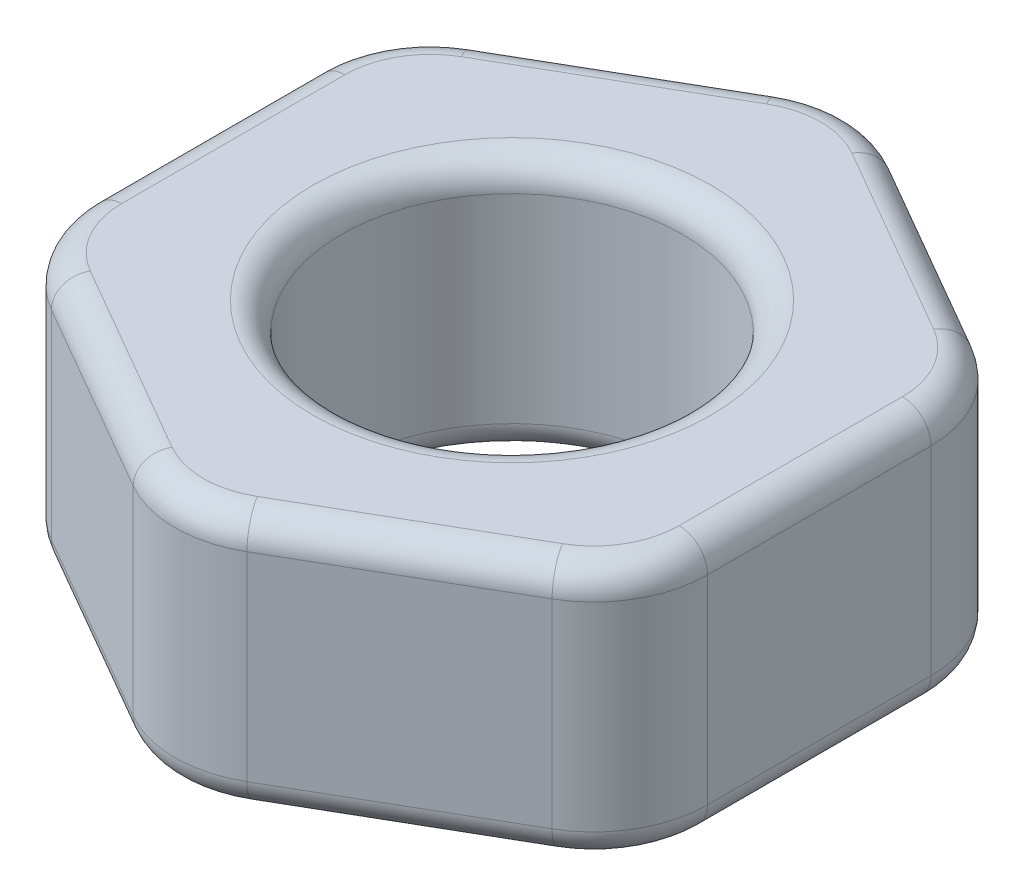
ISO-10303-21;
HEADER;
FILE_DESCRIPTION(('STEP AP214'),'2;1');
FILE_NAME('part.step','',(''),(''),'','','');
FILE_SCHEMA(('AUTOMOTIVE_DESIGN { 1 0 10303 214 1 1 1 1 }'));
ENDSEC;
DATA;
#1=APPLICATION_CONTEXT('core data for automotive mechanical design processes');
#2=APPLICATION_PROTOCOL_DEFINITION('international standard','automotive_design',2000,#1);
#3=PRODUCT_CONTEXT('',#1,'mechanical');
#4=PRODUCT('Part','Part','',(#3));
#5=PRODUCT_RELATED_PRODUCT_CATEGORY('part','',(#4));
#6=PRODUCT_DEFINITION_FORMATION('','',#4);
#7=PRODUCT_DEFINITION_CONTEXT('part definition',#1,'design');
#8=PRODUCT_DEFINITION('design','',#6,#7);
#9=PRODUCT_DEFINITION_SHAPE('','',#8);
#10=(LENGTH_UNIT() NAMED_UNIT(*) SI_UNIT(.MILLI.,.METRE.));
#11=(NAMED_UNIT(*) PLANE_ANGLE_UNIT() SI_UNIT($,.RADIAN.));
#12=(NAMED_UNIT(*) SI_UNIT($,.STERADIAN.) SOLID_ANGLE_UNIT());
#13=UNCERTAINTY_MEASURE_WITH_UNIT(LENGTH_MEASURE(1.E-05),#10,'distance_accuracy_value','');
#14=(GEOMETRIC_REPRESENTATION_CONTEXT(3) GLOBAL_UNCERTAINTY_ASSIGNED_CONTEXT((#13)) GLOBAL_UNIT_ASSIGNED_CONTEXT((#10,
#11,#12)) REPRESENTATION_CONTEXT('',''));
#15=CARTESIAN_POINT('',(0.,0.,0.));
#16=DIRECTION('',(0.,0.,1.));
#17=DIRECTION('',(1.,0.,0.));
#18=AXIS2_PLACEMENT_3D('',#15,#16,#17);
#19=CARTESIAN_POINT('',(0.,2.25,0.));
#20=DIRECTION('',(0.,1.,0.));
#21=DIRECTION('',(0.,0.,1.));
#22=AXIS2_PLACEMENT_3D('',#19,#20,#21);
#23=PLANE('',#22);
#24=CARTESIAN_POINT('',(0.,2.25,0.));
#25=DIRECTION('',(0.,1.,0.));
#26=DIRECTION('',(0.,0.,1.));
#27=AXIS2_PLACEMENT_3D('',#24,#25,#26);
#28=CIRCLE('',#27,1.75);
#29=CARTESIAN_POINT('',(0.,2.25,1.75));
#30=VERTEX_POINT('',#29);
#31=EDGE_CURVE('E11',#30,#30,#28,.F.);
#32=ORIENTED_EDGE('',*,*,#31,.T.);
#33=EDGE_LOOP('',(#32));
#34=FACE_BOUND('',#33,.T.);
#35=DIRECTION('',(0.,0.,-1.));
#36=VECTOR('',#35,1.);
#37=CARTESIAN_POINT('',(2.45,2.25,-0.981495457622363));
#38=LINE('',#37,#36);
#39=CARTESIAN_POINT('',(2.45,2.25,0.981495457622365));
#40=VERTEX_POINT('',#39);
#41=CARTESIAN_POINT('',(2.45,2.25,-0.981495457622363));
#42=VERTEX_POINT('',#41);
#43=EDGE_CURVE('E51',#40,#42,#38,.T.);
#44=ORIENTED_EDGE('',*,*,#43,.T.);
#45=CARTESIAN_POINT('',(1.7,2.25,-0.981495457622363));
#46=DIRECTION('',(0.,1.,0.));
#47=DIRECTION('',(0.,0.,1.));
#48=AXIS2_PLACEMENT_3D('',#45,#46,#47);
#49=CIRCLE('',#48,0.75);
#50=CARTESIAN_POINT('',(2.075,2.25,-1.63101451046069));
#51=VERTEX_POINT('',#50);
#52=EDGE_CURVE('E43',#42,#51,#49,.T.);
#53=ORIENTED_EDGE('',*,*,#52,.T.);
#54=DIRECTION('',(-0.866025403784439,0.,-0.5));
#55=VECTOR('',#54,1.);
#56=CARTESIAN_POINT('',(0.375,2.25,-2.61250996808306));
#57=LINE('',#56,#55);
#58=CARTESIAN_POINT('',(0.375,2.25,-2.61250996808306));
#59=VERTEX_POINT('',#58);
#60=EDGE_CURVE('E285',#51,#59,#57,.T.);
#61=ORIENTED_EDGE('',*,*,#60,.T.);
#62=CARTESIAN_POINT('',(0.,2.25,-1.96299091524473));
#63=DIRECTION('',(0.,1.,0.));
#64=DIRECTION('',(0.,0.,1.));
#65=AXIS2_PLACEMENT_3D('',#62,#63,#64);
#66=CIRCLE('',#65,0.75);
#67=CARTESIAN_POINT('',(-0.375,2.25,-2.61250996808306));
#68=VERTEX_POINT('',#67);
#69=EDGE_CURVE('E287',#59,#68,#66,.T.);
#70=ORIENTED_EDGE('',*,*,#69,.T.);
#71=DIRECTION('',(-0.866025403784439,0.,0.5));
#72=VECTOR('',#71,1.);
#73=CARTESIAN_POINT('',(-2.075,2.25,-1.63101451046069));
#74=LINE('',#73,#72);
#75=CARTESIAN_POINT('',(-2.075,2.25,-1.63101451046069));
#76=VERTEX_POINT('',#75);
#77=EDGE_CURVE('E289',#68,#76,#74,.T.);
#78=ORIENTED_EDGE('',*,*,#77,.T.);
#79=CARTESIAN_POINT('',(-1.7,2.25,-0.981495457622364));
#80=DIRECTION('',(0.,1.,0.));
#81=DIRECTION('',(0.,0.,1.));
#82=AXIS2_PLACEMENT_3D('',#79,#80,#81);
#83=CIRCLE('',#82,0.75);
#84=CARTESIAN_POINT('',(-2.45,2.25,-0.981495457622364));
#85=VERTEX_POINT('',#84);
#86=EDGE_CURVE('E291',#76,#85,#83,.T.);
#87=ORIENTED_EDGE('',*,*,#86,.T.);
#88=DIRECTION('',(0.,0.,1.));
#89=VECTOR('',#88,1.);
#90=CARTESIAN_POINT('',(-2.45,2.25,0.981495457622363));
#91=LINE('',#90,#89);
#92=CARTESIAN_POINT('',(-2.45,2.25,0.981495457622363));
#93=VERTEX_POINT('',#92);
#94=EDGE_CURVE('E293',#85,#93,#91,.T.);
#95=ORIENTED_EDGE('',*,*,#94,.T.);
#96=CARTESIAN_POINT('',(-1.7,2.25,0.981495457622363));
#97=DIRECTION('',(0.,1.,0.));
#98=DIRECTION('',(0.,0.,1.));
#99=AXIS2_PLACEMENT_3D('',#96,#97,#98);
#100=CIRCLE('',#99,0.75);
#101=CARTESIAN_POINT('',(-2.075,2.25,1.63101451046069));
#102=VERTEX_POINT('',#101);
#103=EDGE_CURVE('E295',#93,#102,#100,.T.);
#104=ORIENTED_EDGE('',*,*,#103,.T.);
#105=DIRECTION('',(0.866025403784439,0.,0.5));
#106=VECTOR('',#105,1.);
#107=CARTESIAN_POINT('',(-0.374999999999998,2.25,2.61250996808306));
#108=LINE('',#107,#106);
#109=CARTESIAN_POINT('',(-0.374999999999998,2.25,2.61250996808306));
#110=VERTEX_POINT('',#109);
#111=EDGE_CURVE('E297',#102,#110,#108,.T.);
#112=ORIENTED_EDGE('',*,*,#111,.T.);
#113=CARTESIAN_POINT('',(0.,2.25,1.96299091524473));
#114=DIRECTION('',(0.,1.,0.));
#115=DIRECTION('',(0.,0.,1.));
#116=AXIS2_PLACEMENT_3D('',#113,#114,#115);
#117=CIRCLE('',#116,0.75);
#118=CARTESIAN_POINT('',(0.375000000000002,2.25,2.61250996808306));
#119=VERTEX_POINT('',#118);
#120=EDGE_CURVE('E299',#110,#119,#117,.T.);
#121=ORIENTED_EDGE('',*,*,#120,.T.);
#122=DIRECTION('',(0.866025403784439,0.,-0.5));
#123=VECTOR('',#122,1.);
#124=CARTESIAN_POINT('',(2.075,2.25,1.63101451046069));
#125=LINE('',#124,#123);
#126=CARTESIAN_POINT('',(2.075,2.25,1.63101451046069));
#127=VERTEX_POINT('',#126);
#128=EDGE_CURVE('E301',#119,#127,#125,.T.);
#129=ORIENTED_EDGE('',*,*,#128,.T.);
#130=CARTESIAN_POINT('',(1.7,2.25,0.981495457622365));
#131=DIRECTION('',(0.,1.,0.));
#132=DIRECTION('',(0.,0.,1.));
#133=AXIS2_PLACEMENT_3D('',#130,#131,#132);
#134=CIRCLE('',#133,0.75);
#135=EDGE_CURVE('E56',#127,#40,#134,.T.);
#136=ORIENTED_EDGE('',*,*,#135,.T.);
#137=EDGE_LOOP('',(#44,#53,#61,#70,#78,#87,#95,#104,#112,#121,#129,#136));
#138=FACE_BOUND('',#137,.T.);
#139=ADVANCED_FACE('F34',(#34,#138),#23,.T.);
#140=CARTESIAN_POINT('',(0.,0.,0.));
#141=DIRECTION('',(0.,1.,0.));
#142=DIRECTION('',(0.,0.,1.));
#143=AXIS2_PLACEMENT_3D('',#140,#141,#142);
#144=PLANE('',#143);
#145=CARTESIAN_POINT('',(0.,0.,0.));
#146=DIRECTION('',(0.,1.,0.));
#147=DIRECTION('',(0.,0.,1.));
#148=AXIS2_PLACEMENT_3D('',#145,#146,#147);
#149=CIRCLE('',#148,1.75);
#150=CARTESIAN_POINT('',(0.,0.,1.75));
#151=VERTEX_POINT('',#150);
#152=EDGE_CURVE('E223',#151,#151,#149,.T.);
#153=ORIENTED_EDGE('',*,*,#152,.T.);
#154=EDGE_LOOP('',(#153));
#155=FACE_BOUND('',#154,.T.);
#156=DIRECTION('',(0.,0.,1.));
#157=VECTOR('',#156,1.);
#158=CARTESIAN_POINT('',(-2.45,0.,0.));
#159=LINE('',#158,#157);
#160=CARTESIAN_POINT('',(-2.45,0.,0.981495457622363));
#161=VERTEX_POINT('',#160);
#162=CARTESIAN_POINT('',(-2.45,0.,-0.981495457622364));
#163=VERTEX_POINT('',#162);
#164=EDGE_CURVE('E221',#161,#163,#159,.F.);
#165=ORIENTED_EDGE('',*,*,#164,.T.);
#166=CARTESIAN_POINT('',(-1.7,0.,-0.981495457622364));
#167=DIRECTION('',(0.,1.,0.));
#168=DIRECTION('',(0.,0.,1.));
#169=AXIS2_PLACEMENT_3D('',#166,#167,#168);
#170=CIRCLE('',#169,0.75);
#171=CARTESIAN_POINT('',(-2.075,0.,-1.63101451046069));
#172=VERTEX_POINT('',#171);
#173=EDGE_CURVE('E202',#163,#172,#170,.F.);
#174=ORIENTED_EDGE('',*,*,#173,.T.);
#175=DIRECTION('',(-0.866025403784439,0.,0.5));
#176=VECTOR('',#175,1.);
#177=CARTESIAN_POINT('',(-1.225,0.,-2.12176223927188));
#178=LINE('',#177,#176);
#179=CARTESIAN_POINT('',(-0.374999999999999,0.,-2.61250996808306));
#180=VERTEX_POINT('',#179);
#181=EDGE_CURVE('E210',#172,#180,#178,.F.);
#182=ORIENTED_EDGE('',*,*,#181,.T.);
#183=CARTESIAN_POINT('',(0.,0.,-1.96299091524473));
#184=DIRECTION('',(0.,1.,0.));
#185=DIRECTION('',(0.,0.,1.));
#186=AXIS2_PLACEMENT_3D('',#183,#184,#185);
#187=CIRCLE('',#186,0.75);
#188=CARTESIAN_POINT('',(0.375000000000001,0.,-2.61250996808306));
#189=VERTEX_POINT('',#188);
#190=EDGE_CURVE('E216',#180,#189,#187,.F.);
#191=ORIENTED_EDGE('',*,*,#190,.T.);
#192=DIRECTION('',(-0.866025403784439,0.,-0.5));
#193=VECTOR('',#192,1.);
#194=CARTESIAN_POINT('',(1.225,0.,-2.12176223927187));
#195=LINE('',#194,#193);
#196=CARTESIAN_POINT('',(2.075,0.,-1.63101451046069));
#197=VERTEX_POINT('',#196);
#198=EDGE_CURVE('E418',#189,#197,#195,.F.);
#199=ORIENTED_EDGE('',*,*,#198,.T.);
#200=CARTESIAN_POINT('',(1.7,0.,-0.981495457622363));
#201=DIRECTION('',(0.,1.,0.));
#202=DIRECTION('',(0.,0.,1.));
#203=AXIS2_PLACEMENT_3D('',#200,#201,#202);
#204=CIRCLE('',#203,0.75);
#205=CARTESIAN_POINT('',(2.45,0.,-0.981495457622363));
#206=VERTEX_POINT('',#205);
#207=EDGE_CURVE('E420',#197,#206,#204,.F.);
#208=ORIENTED_EDGE('',*,*,#207,.T.);
#209=DIRECTION('',(0.,0.,-1.));
#210=VECTOR('',#209,1.);
#211=CARTESIAN_POINT('',(2.45,0.,0.));
#212=LINE('',#211,#210);
#213=CARTESIAN_POINT('',(2.45,0.,0.981495457622365));
#214=VERTEX_POINT('',#213);
#215=EDGE_CURVE('E422',#206,#214,#212,.F.);
#216=ORIENTED_EDGE('',*,*,#215,.T.);
#217=CARTESIAN_POINT('',(1.7,0.,0.981495457622365));
#218=DIRECTION('',(0.,1.,0.));
#219=DIRECTION('',(0.,0.,1.));
#220=AXIS2_PLACEMENT_3D('',#217,#218,#219);
#221=CIRCLE('',#220,0.75);
#222=CARTESIAN_POINT('',(2.075,0.,1.63101451046069));
#223=VERTEX_POINT('',#222);
#224=EDGE_CURVE('E424',#214,#223,#221,.F.);
#225=ORIENTED_EDGE('',*,*,#224,.T.);
#226=DIRECTION('',(0.866025403784439,0.,-0.5));
#227=VECTOR('',#226,1.);
#228=CARTESIAN_POINT('',(1.225,0.,2.12176223927188));
#229=LINE('',#228,#227);
#230=CARTESIAN_POINT('',(0.375000000000001,0.,2.61250996808306));
#231=VERTEX_POINT('',#230);
#232=EDGE_CURVE('E426',#223,#231,#229,.F.);
#233=ORIENTED_EDGE('',*,*,#232,.T.);
#234=CARTESIAN_POINT('',(0.,0.,1.96299091524473));
#235=DIRECTION('',(0.,1.,0.));
#236=DIRECTION('',(0.,0.,1.));
#237=AXIS2_PLACEMENT_3D('',#234,#235,#236);
#238=CIRCLE('',#237,0.75);
#239=CARTESIAN_POINT('',(-0.374999999999998,0.,2.61250996808306));
#240=VERTEX_POINT('',#239);
#241=EDGE_CURVE('E428',#231,#240,#238,.F.);
#242=ORIENTED_EDGE('',*,*,#241,.T.);
#243=DIRECTION('',(0.866025403784439,0.,0.5));
#244=VECTOR('',#243,1.);
#245=CARTESIAN_POINT('',(-1.225,0.,2.12176223927187));
#246=LINE('',#245,#244);
#247=CARTESIAN_POINT('',(-2.075,0.,1.63101451046069));
#248=VERTEX_POINT('',#247);
#249=EDGE_CURVE('E430',#240,#248,#246,.F.);
#250=ORIENTED_EDGE('',*,*,#249,.T.);
#251=CARTESIAN_POINT('',(-1.7,0.,0.981495457622363));
#252=DIRECTION('',(0.,1.,0.));
#253=DIRECTION('',(0.,0.,1.));
#254=AXIS2_PLACEMENT_3D('',#251,#252,#253);
#255=CIRCLE('',#254,0.75);
#256=EDGE_CURVE('E228',#248,#161,#255,.F.);
#257=ORIENTED_EDGE('',*,*,#256,.T.);
#258=EDGE_LOOP('',(#165,#174,#182,#191,#199,#208,#216,#225,#233,#242,#250,#257));
#259=FACE_BOUND('',#258,.T.);
#260=ADVANCED_FACE('F219',(#155,#259),#144,.F.);
#261=CARTESIAN_POINT('',(0.,2.25,3.11769145362398));
#262=DIRECTION('',(-0.5,0.,-0.866025403784439));
#263=DIRECTION('',(-0.866025403784439,0.,0.5));
#264=AXIS2_PLACEMENT_3D('',#261,#262,#263);
#265=PLANE('',#264);
#266=DIRECTION('',(0.,-1.,0.));
#267=VECTOR('',#266,1.);
#268=CARTESIAN_POINT('',(0.500000000000001,2.25,2.82901631902917));
#269=LINE('',#268,#267);
#270=CARTESIAN_POINT('',(0.500000000000001,2.,2.82901631902917));
#271=VERTEX_POINT('',#270);
#272=CARTESIAN_POINT('',(0.500000000000001,0.25,2.82901631902917));
#273=VERTEX_POINT('',#272);
#274=EDGE_CURVE('E412',#271,#273,#269,.T.);
#275=ORIENTED_EDGE('',*,*,#274,.T.);
#276=DIRECTION('',(0.866025403784439,0.,-0.5));
#277=VECTOR('',#276,1.);
#278=CARTESIAN_POINT('',(0.,0.25,3.11769145362398));
#279=LINE('',#278,#277);
#280=CARTESIAN_POINT('',(2.2,0.25,1.8475208614068));
#281=VERTEX_POINT('',#280);
#282=EDGE_CURVE('E258',#273,#281,#279,.T.);
#283=ORIENTED_EDGE('',*,*,#282,.T.);
#284=DIRECTION('',(0.,-1.,0.));
#285=VECTOR('',#284,1.);
#286=CARTESIAN_POINT('',(2.2,2.25,1.8475208614068));
#287=LINE('',#286,#285);
#288=CARTESIAN_POINT('',(2.2,2.,1.8475208614068));
#289=VERTEX_POINT('',#288);
#290=EDGE_CURVE('E217',#281,#289,#287,.F.);
#291=ORIENTED_EDGE('',*,*,#290,.T.);
#292=DIRECTION('',(0.866025403784439,0.,-0.5));
#293=VECTOR('',#292,1.);
#294=CARTESIAN_POINT('',(0.500000000000001,2.,2.82901631902917));
#295=LINE('',#294,#293);
#296=EDGE_CURVE('E256',#289,#271,#295,.F.);
#297=ORIENTED_EDGE('',*,*,#296,.T.);
#298=EDGE_LOOP('',(#275,#283,#291,#297));
#299=FACE_BOUND('',#298,.T.);
#300=ADVANCED_FACE('F557',(#299),#265,.F.);
#301=CARTESIAN_POINT('',(2.7,2.25,1.55884572681199));
#302=DIRECTION('',(-1.,0.,0.));
#303=DIRECTION('',(0.,0.,1.));
#304=AXIS2_PLACEMENT_3D('',#301,#302,#303);
#305=PLANE('',#304);
#306=DIRECTION('',(0.,-1.,0.));
#307=VECTOR('',#306,1.);
#308=CARTESIAN_POINT('',(2.7,2.25,0.981495457622365));
#309=LINE('',#308,#307);
#310=CARTESIAN_POINT('',(2.7,2.,0.981495457622365));
#311=VERTEX_POINT('',#310);
#312=CARTESIAN_POINT('',(2.7,0.25,0.981495457622365));
#313=VERTEX_POINT('',#312);
#314=EDGE_CURVE('E406',#311,#313,#309,.T.);
#315=ORIENTED_EDGE('',*,*,#314,.T.);
#316=DIRECTION('',(0.,0.,-1.));
#317=VECTOR('',#316,1.);
#318=CARTESIAN_POINT('',(2.7,0.25,1.55884572681199));
#319=LINE('',#318,#317);
#320=CARTESIAN_POINT('',(2.7,0.25,-0.981495457622363));
#321=VERTEX_POINT('',#320);
#322=EDGE_CURVE('E266',#313,#321,#319,.T.);
#323=ORIENTED_EDGE('',*,*,#322,.T.);
#324=DIRECTION('',(0.,-1.,0.));
#325=VECTOR('',#324,1.);
#326=CARTESIAN_POINT('',(2.7,2.25,-0.981495457622363));
#327=LINE('',#326,#325);
#328=CARTESIAN_POINT('',(2.7,2.,-0.981495457622363));
#329=VERTEX_POINT('',#328);
#330=EDGE_CURVE('E409',#321,#329,#327,.F.);
#331=ORIENTED_EDGE('',*,*,#330,.T.);
#332=DIRECTION('',(0.,0.,-1.));
#333=VECTOR('',#332,1.);
#334=CARTESIAN_POINT('',(2.7,2.,0.981495457622365));
#335=LINE('',#334,#333);
#336=EDGE_CURVE('E264',#329,#311,#335,.F.);
#337=ORIENTED_EDGE('',*,*,#336,.T.);
#338=EDGE_LOOP('',(#315,#323,#331,#337));
#339=FACE_BOUND('',#338,.T.);
#340=ADVANCED_FACE('F498',(#339),#305,.F.);
#341=CARTESIAN_POINT('',(2.7,2.25,-1.55884572681199));
#342=DIRECTION('',(-0.5,0.,0.866025403784439));
#343=DIRECTION('',(0.866025403784439,0.,0.5));
#344=AXIS2_PLACEMENT_3D('',#341,#342,#343);
#345=PLANE('',#344);
#346=DIRECTION('',(0.,-1.,0.));
#347=VECTOR('',#346,1.);
#348=CARTESIAN_POINT('',(2.2,2.25,-1.8475208614068));
#349=LINE('',#348,#347);
#350=CARTESIAN_POINT('',(2.2,2.,-1.8475208614068));
#351=VERTEX_POINT('',#350);
#352=CARTESIAN_POINT('',(2.2,0.25,-1.8475208614068));
#353=VERTEX_POINT('',#352);
#354=EDGE_CURVE('E399',#351,#353,#349,.T.);
#355=ORIENTED_EDGE('',*,*,#354,.T.);
#356=DIRECTION('',(-0.866025403784439,0.,-0.5));
#357=VECTOR('',#356,1.);
#358=CARTESIAN_POINT('',(2.7,0.25,-1.55884572681199));
#359=LINE('',#358,#357);
#360=CARTESIAN_POINT('',(0.5,0.25,-2.82901631902917));
#361=VERTEX_POINT('',#360);
#362=EDGE_CURVE('E275',#353,#361,#359,.T.);
#363=ORIENTED_EDGE('',*,*,#362,.T.);
#364=DIRECTION('',(0.,-1.,0.));
#365=VECTOR('',#364,1.);
#366=CARTESIAN_POINT('',(0.5,2.25,-2.82901631902917));
#367=LINE('',#366,#365);
#368=CARTESIAN_POINT('',(0.5,2.,-2.82901631902917));
#369=VERTEX_POINT('',#368);
#370=EDGE_CURVE('E394',#361,#369,#367,.F.);
#371=ORIENTED_EDGE('',*,*,#370,.T.);
#372=DIRECTION('',(-0.866025403784439,0.,-0.5));
#373=VECTOR('',#372,1.);
#374=CARTESIAN_POINT('',(2.2,2.,-1.8475208614068));
#375=LINE('',#374,#373);
#376=EDGE_CURVE('E273',#369,#351,#375,.F.);
#377=ORIENTED_EDGE('',*,*,#376,.T.);
#378=EDGE_LOOP('',(#355,#363,#371,#377));
#379=FACE_BOUND('',#378,.T.);
#380=ADVANCED_FACE('F455',(#379),#345,.F.);
#381=CARTESIAN_POINT('',(0.,2.25,-3.11769145362398));
#382=DIRECTION('',(0.5,0.,0.866025403784439));
#383=DIRECTION('',(0.866025403784439,0.,-0.5));
#384=AXIS2_PLACEMENT_3D('',#381,#382,#383);
#385=PLANE('',#384);
#386=DIRECTION('',(0.,-1.,0.));
#387=VECTOR('',#386,1.);
#388=CARTESIAN_POINT('',(-0.499999999999999,2.25,-2.82901631902917));
#389=LINE('',#388,#387);
#390=CARTESIAN_POINT('',(-0.499999999999999,2.,-2.82901631902917));
#391=VERTEX_POINT('',#390);
#392=CARTESIAN_POINT('',(-0.499999999999999,0.25,-2.82901631902917));
#393=VERTEX_POINT('',#392);
#394=EDGE_CURVE('E447',#391,#393,#389,.T.);
#395=ORIENTED_EDGE('',*,*,#394,.T.);
#396=DIRECTION('',(-0.866025403784439,0.,0.5));
#397=VECTOR('',#396,1.);
#398=CARTESIAN_POINT('',(0.,0.25,-3.11769145362398));
#399=LINE('',#398,#397);
#400=CARTESIAN_POINT('',(-2.2,0.25,-1.8475208614068));
#401=VERTEX_POINT('',#400);
#402=EDGE_CURVE('E283',#393,#401,#399,.T.);
#403=ORIENTED_EDGE('',*,*,#402,.T.);
#404=DIRECTION('',(0.,-1.,0.));
#405=VECTOR('',#404,1.);
#406=CARTESIAN_POINT('',(-2.2,2.25,-1.8475208614068));
#407=LINE('',#406,#405);
#408=CARTESIAN_POINT('',(-2.2,2.,-1.8475208614068));
#409=VERTEX_POINT('',#408);
#410=EDGE_CURVE('E335',#401,#409,#407,.F.);
#411=ORIENTED_EDGE('',*,*,#410,.T.);
#412=DIRECTION('',(-0.866025403784439,0.,0.5));
#413=VECTOR('',#412,1.);
#414=CARTESIAN_POINT('',(-0.499999999999999,2.,-2.82901631902917));
#415=LINE('',#414,#413);
#416=EDGE_CURVE('E281',#409,#391,#415,.F.);
#417=ORIENTED_EDGE('',*,*,#416,.T.);
#418=EDGE_LOOP('',(#395,#403,#411,#417));
#419=FACE_BOUND('',#418,.T.);
#420=ADVANCED_FACE('F476',(#419),#385,.F.);
#421=CARTESIAN_POINT('',(-2.7,2.25,-1.55884572681199));
#422=DIRECTION('',(1.,0.,0.));
#423=DIRECTION('',(0.,0.,-1.));
#424=AXIS2_PLACEMENT_3D('',#421,#422,#423);
#425=PLANE('',#424);
#426=DIRECTION('',(0.,-1.,0.));
#427=VECTOR('',#426,1.);
#428=CARTESIAN_POINT('',(-2.7,2.25,-0.981495457622364));
#429=LINE('',#428,#427);
#430=CARTESIAN_POINT('',(-2.7,2.,-0.981495457622364));
#431=VERTEX_POINT('',#430);
#432=CARTESIAN_POINT('',(-2.7,0.25,-0.981495457622364));
#433=VERTEX_POINT('',#432);
#434=EDGE_CURVE('E393',#431,#433,#429,.T.);
#435=ORIENTED_EDGE('',*,*,#434,.T.);
#436=DIRECTION('',(0.,0.,1.));
#437=VECTOR('',#436,1.);
#438=CARTESIAN_POINT('',(-2.7,0.25,-1.55884572681199));
#439=LINE('',#438,#437);
#440=CARTESIAN_POINT('',(-2.7,0.25,0.981495457622363));
#441=VERTEX_POINT('',#440);
#442=EDGE_CURVE('E242',#433,#441,#439,.T.);
#443=ORIENTED_EDGE('',*,*,#442,.T.);
#444=DIRECTION('',(0.,-1.,0.));
#445=VECTOR('',#444,1.);
#446=CARTESIAN_POINT('',(-2.7,2.25,0.981495457622363));
#447=LINE('',#446,#445);
#448=CARTESIAN_POINT('',(-2.7,2.,0.981495457622363));
#449=VERTEX_POINT('',#448);
#450=EDGE_CURVE('E384',#441,#449,#447,.F.);
#451=ORIENTED_EDGE('',*,*,#450,.T.);
#452=DIRECTION('',(0.,0.,1.));
#453=VECTOR('',#452,1.);
#454=CARTESIAN_POINT('',(-2.7,2.,-0.981495457622364));
#455=LINE('',#454,#453);
#456=EDGE_CURVE('E240',#449,#431,#455,.F.);
#457=ORIENTED_EDGE('',*,*,#456,.T.);
#458=EDGE_LOOP('',(#435,#443,#451,#457));
#459=FACE_BOUND('',#458,.T.);
#460=ADVANCED_FACE('F390',(#459),#425,.F.);
#461=CARTESIAN_POINT('',(-2.7,2.25,1.55884572681199));
#462=DIRECTION('',(0.5,0.,-0.866025403784439));
#463=DIRECTION('',(-0.866025403784439,0.,-0.5));
#464=AXIS2_PLACEMENT_3D('',#461,#462,#463);
#465=PLANE('',#464);
#466=DIRECTION('',(0.,-1.,0.));
#467=VECTOR('',#466,1.);
#468=CARTESIAN_POINT('',(-2.2,2.25,1.8475208614068));
#469=LINE('',#468,#467);
#470=CARTESIAN_POINT('',(-2.2,2.,1.8475208614068));
#471=VERTEX_POINT('',#470);
#472=CARTESIAN_POINT('',(-2.2,0.25,1.8475208614068));
#473=VERTEX_POINT('',#472);
#474=EDGE_CURVE('E387',#471,#473,#469,.T.);
#475=ORIENTED_EDGE('',*,*,#474,.T.);
#476=DIRECTION('',(0.866025403784439,0.,0.5));
#477=VECTOR('',#476,1.);
#478=CARTESIAN_POINT('',(-2.7,0.25,1.55884572681199));
#479=LINE('',#478,#477);
#480=CARTESIAN_POINT('',(-0.499999999999998,0.25,2.82901631902917));
#481=VERTEX_POINT('',#480);
#482=EDGE_CURVE('E250',#473,#481,#479,.T.);
#483=ORIENTED_EDGE('',*,*,#482,.T.);
#484=DIRECTION('',(0.,-1.,0.));
#485=VECTOR('',#484,1.);
#486=CARTESIAN_POINT('',(-0.499999999999998,2.25,2.82901631902917));
#487=LINE('',#486,#485);
#488=CARTESIAN_POINT('',(-0.499999999999998,2.,2.82901631902917));
#489=VERTEX_POINT('',#488);
#490=EDGE_CURVE('E396',#481,#489,#487,.F.);
#491=ORIENTED_EDGE('',*,*,#490,.T.);
#492=DIRECTION('',(0.866025403784439,0.,0.5));
#493=VECTOR('',#492,1.);
#494=CARTESIAN_POINT('',(-2.2,2.,1.8475208614068));
#495=LINE('',#494,#493);
#496=EDGE_CURVE('E248',#489,#471,#495,.F.);
#497=ORIENTED_EDGE('',*,*,#496,.T.);
#498=EDGE_LOOP('',(#475,#483,#491,#497));
#499=FACE_BOUND('',#498,.T.);
#500=ADVANCED_FACE('F525',(#499),#465,.F.);
#501=CARTESIAN_POINT('',(0.,2.25,0.));
#502=DIRECTION('',(0.,-1.,0.));
#503=DIRECTION('',(0.,0.,-1.));
#504=AXIS2_PLACEMENT_3D('',#501,#502,#503);
#505=CYLINDRICAL_SURFACE('',#504,1.5);
#506=CARTESIAN_POINT('',(0.,0.25,0.));
#507=DIRECTION('',(0.,1.,0.));
#508=DIRECTION('',(0.,0.,1.));
#509=AXIS2_PLACEMENT_3D('',#506,#507,#508);
#510=CIRCLE('',#509,1.5);
#511=CARTESIAN_POINT('',(0.,0.25,1.5));
#512=VERTEX_POINT('',#511);
#513=EDGE_CURVE('E234',#512,#512,#510,.F.);
#514=ORIENTED_EDGE('',*,*,#513,.T.);
#515=EDGE_LOOP('',(#514));
#516=FACE_BOUND('',#515,.T.);
#517=CARTESIAN_POINT('',(0.,2.,0.));
#518=DIRECTION('',(0.,1.,0.));
#519=DIRECTION('',(0.,0.,1.));
#520=AXIS2_PLACEMENT_3D('',#517,#518,#519);
#521=CIRCLE('',#520,1.5);
#522=CARTESIAN_POINT('',(0.,2.,1.5));
#523=VERTEX_POINT('',#522);
#524=EDGE_CURVE('E226',#523,#523,#521,.T.);
#525=ORIENTED_EDGE('',*,*,#524,.T.);
#526=EDGE_LOOP('',(#525));
#527=FACE_BOUND('',#526,.T.);
#528=ADVANCED_FACE('F561',(#516,#527),#505,.F.);
#529=CARTESIAN_POINT('',(0.,2.25,-1.96299091524473));
#530=DIRECTION('',(0.,-1.,0.));
#531=DIRECTION('',(0.,0.,-1.));
#532=AXIS2_PLACEMENT_3D('',#529,#530,#531);
#533=CYLINDRICAL_SURFACE('',#532,1.);
#534=ORIENTED_EDGE('',*,*,#370,.F.);
#535=CARTESIAN_POINT('',(0.,0.25,-1.96299091524473));
#536=DIRECTION('',(0.,1.,0.));
#537=DIRECTION('',(0.,0.,1.));
#538=AXIS2_PLACEMENT_3D('',#535,#536,#537);
#539=CIRCLE('',#538,1.);
#540=EDGE_CURVE('E279',#361,#393,#539,.T.);
#541=ORIENTED_EDGE('',*,*,#540,.T.);
#542=ORIENTED_EDGE('',*,*,#394,.F.);
#543=CARTESIAN_POINT('',(0.,2.,-1.96299091524473));
#544=DIRECTION('',(0.,1.,0.));
#545=DIRECTION('',(0.,0.,1.));
#546=AXIS2_PLACEMENT_3D('',#543,#544,#545);
#547=CIRCLE('',#546,1.);
#548=EDGE_CURVE('E277',#391,#369,#547,.F.);
#549=ORIENTED_EDGE('',*,*,#548,.T.);
#550=EDGE_LOOP('',(#534,#541,#542,#549));
#551=FACE_BOUND('',#550,.T.);
#552=ADVANCED_FACE('F474',(#551),#533,.T.);
#553=CARTESIAN_POINT('',(-1.7,2.25,-0.981495457622364));
#554=DIRECTION('',(0.,-1.,0.));
#555=DIRECTION('',(0.,0.,-1.));
#556=AXIS2_PLACEMENT_3D('',#553,#554,#555);
#557=CYLINDRICAL_SURFACE('',#556,1.);
#558=ORIENTED_EDGE('',*,*,#410,.F.);
#559=CARTESIAN_POINT('',(-1.7,0.25,-0.981495457622364));
#560=DIRECTION('',(0.,1.,0.));
#561=DIRECTION('',(0.,0.,1.));
#562=AXIS2_PLACEMENT_3D('',#559,#560,#561);
#563=CIRCLE('',#562,1.);
#564=EDGE_CURVE('E204',#401,#433,#563,.T.);
#565=ORIENTED_EDGE('',*,*,#564,.T.);
#566=ORIENTED_EDGE('',*,*,#434,.F.);
#567=CARTESIAN_POINT('',(-1.7,2.,-0.981495457622364));
#568=DIRECTION('',(0.,1.,0.));
#569=DIRECTION('',(0.,0.,1.));
#570=AXIS2_PLACEMENT_3D('',#567,#568,#569);
#571=CIRCLE('',#570,1.);
#572=EDGE_CURVE('E237',#431,#409,#571,.F.);
#573=ORIENTED_EDGE('',*,*,#572,.T.);
#574=EDGE_LOOP('',(#558,#565,#566,#573));
#575=FACE_BOUND('',#574,.T.);
#576=ADVANCED_FACE('F441',(#575),#557,.T.);
#577=CARTESIAN_POINT('',(-1.7,2.25,0.981495457622363));
#578=DIRECTION('',(0.,-1.,0.));
#579=DIRECTION('',(0.,0.,-1.));
#580=AXIS2_PLACEMENT_3D('',#577,#578,#579);
#581=CYLINDRICAL_SURFACE('',#580,1.);
#582=ORIENTED_EDGE('',*,*,#450,.F.);
#583=CARTESIAN_POINT('',(-1.7,0.25,0.981495457622363));
#584=DIRECTION('',(0.,1.,0.));
#585=DIRECTION('',(0.,0.,1.));
#586=AXIS2_PLACEMENT_3D('',#583,#584,#585);
#587=CIRCLE('',#586,1.);
#588=EDGE_CURVE('E246',#441,#473,#587,.T.);
#589=ORIENTED_EDGE('',*,*,#588,.T.);
#590=ORIENTED_EDGE('',*,*,#474,.F.);
#591=CARTESIAN_POINT('',(-1.7,2.,0.981495457622363));
#592=DIRECTION('',(0.,1.,0.));
#593=DIRECTION('',(0.,0.,1.));
#594=AXIS2_PLACEMENT_3D('',#591,#592,#593);
#595=CIRCLE('',#594,1.);
#596=EDGE_CURVE('E244',#471,#449,#595,.F.);
#597=ORIENTED_EDGE('',*,*,#596,.T.);
#598=EDGE_LOOP('',(#582,#589,#590,#597));
#599=FACE_BOUND('',#598,.T.);
#600=ADVANCED_FACE('F383',(#599),#581,.T.);
#601=CARTESIAN_POINT('',(1.7,2.25,-0.981495457622363));
#602=DIRECTION('',(0.,-1.,0.));
#603=DIRECTION('',(0.,0.,-1.));
#604=AXIS2_PLACEMENT_3D('',#601,#602,#603);
#605=CYLINDRICAL_SURFACE('',#604,1.);
#606=ORIENTED_EDGE('',*,*,#330,.F.);
#607=CARTESIAN_POINT('',(1.7,0.25,-0.981495457622363));
#608=DIRECTION('',(0.,1.,0.));
#609=DIRECTION('',(0.,0.,1.));
#610=AXIS2_PLACEMENT_3D('',#607,#608,#609);
#611=CIRCLE('',#610,1.);
#612=EDGE_CURVE('E271',#321,#353,#611,.T.);
#613=ORIENTED_EDGE('',*,*,#612,.T.);
#614=ORIENTED_EDGE('',*,*,#354,.F.);
#615=CARTESIAN_POINT('',(1.7,2.,-0.981495457622363));
#616=DIRECTION('',(0.,1.,0.));
#617=DIRECTION('',(0.,0.,1.));
#618=AXIS2_PLACEMENT_3D('',#615,#616,#617);
#619=CIRCLE('',#618,1.);
#620=EDGE_CURVE('E268',#351,#329,#619,.F.);
#621=ORIENTED_EDGE('',*,*,#620,.T.);
#622=EDGE_LOOP('',(#606,#613,#614,#621));
#623=FACE_BOUND('',#622,.T.);
#624=ADVANCED_FACE('F495',(#623),#605,.T.);
#625=CARTESIAN_POINT('',(1.7,2.25,0.981495457622365));
#626=DIRECTION('',(0.,-1.,0.));
#627=DIRECTION('',(0.,0.,-1.));
#628=AXIS2_PLACEMENT_3D('',#625,#626,#627);
#629=CYLINDRICAL_SURFACE('',#628,1.);
#630=ORIENTED_EDGE('',*,*,#290,.F.);
#631=CARTESIAN_POINT('',(1.7,0.25,0.981495457622365));
#632=DIRECTION('',(0.,1.,0.));
#633=DIRECTION('',(0.,0.,1.));
#634=AXIS2_PLACEMENT_3D('',#631,#632,#633);
#635=CIRCLE('',#634,1.);
#636=EDGE_CURVE('E262',#281,#313,#635,.T.);
#637=ORIENTED_EDGE('',*,*,#636,.T.);
#638=ORIENTED_EDGE('',*,*,#314,.F.);
#639=CARTESIAN_POINT('',(1.7,2.,0.981495457622365));
#640=DIRECTION('',(0.,1.,0.));
#641=DIRECTION('',(0.,0.,1.));
#642=AXIS2_PLACEMENT_3D('',#639,#640,#641);
#643=CIRCLE('',#642,1.);
#644=EDGE_CURVE('E260',#311,#289,#643,.F.);
#645=ORIENTED_EDGE('',*,*,#644,.T.);
#646=EDGE_LOOP('',(#630,#637,#638,#645));
#647=FACE_BOUND('',#646,.T.);
#648=ADVANCED_FACE('F584',(#647),#629,.T.);
#649=CARTESIAN_POINT('',(0.,2.25,1.96299091524473));
#650=DIRECTION('',(0.,-1.,0.));
#651=DIRECTION('',(0.,0.,-1.));
#652=AXIS2_PLACEMENT_3D('',#649,#650,#651);
#653=CYLINDRICAL_SURFACE('',#652,1.);
#654=ORIENTED_EDGE('',*,*,#490,.F.);
#655=CARTESIAN_POINT('',(0.,0.25,1.96299091524473));
#656=DIRECTION('',(0.,1.,0.));
#657=DIRECTION('',(0.,0.,1.));
#658=AXIS2_PLACEMENT_3D('',#655,#656,#657);
#659=CIRCLE('',#658,1.);
#660=EDGE_CURVE('E254',#481,#273,#659,.T.);
#661=ORIENTED_EDGE('',*,*,#660,.T.);
#662=ORIENTED_EDGE('',*,*,#274,.F.);
#663=CARTESIAN_POINT('',(0.,2.,1.96299091524473));
#664=DIRECTION('',(0.,1.,0.));
#665=DIRECTION('',(0.,0.,1.));
#666=AXIS2_PLACEMENT_3D('',#663,#664,#665);
#667=CIRCLE('',#666,1.);
#668=EDGE_CURVE('E252',#271,#489,#667,.F.);
#669=ORIENTED_EDGE('',*,*,#668,.T.);
#670=EDGE_LOOP('',(#654,#661,#662,#669));
#671=FACE_BOUND('',#670,.T.);
#672=ADVANCED_FACE('F527',(#671),#653,.T.);
#673=CARTESIAN_POINT('',(0.,0.25,0.));
#674=DIRECTION('',(0.,1.,0.));
#675=DIRECTION('',(0.,0.,1.));
#676=AXIS2_PLACEMENT_3D('',#673,#674,#675);
#677=TOROIDAL_SURFACE('',#676,1.75,0.25);
#678=ORIENTED_EDGE('',*,*,#513,.F.);
#679=EDGE_LOOP('',(#678));
#680=FACE_BOUND('',#679,.T.);
#681=ORIENTED_EDGE('',*,*,#152,.F.);
#682=EDGE_LOOP('',(#681));
#683=FACE_BOUND('',#682,.T.);
#684=ADVANCED_FACE('F590',(#680,#683),#677,.T.);
#685=CARTESIAN_POINT('',(1.7,0.25,0.981495457622365));
#686=DIRECTION('',(0.,1.,0.));
#687=DIRECTION('',(0.,0.,1.));
#688=AXIS2_PLACEMENT_3D('',#685,#686,#687);
#689=TOROIDAL_SURFACE('',#688,0.75,0.25);
#690=CARTESIAN_POINT('',(2.45,0.25,0.981495457622365));
#691=DIRECTION('',(0.,0.,-1.));
#692=DIRECTION('',(-1.,0.,0.));
#693=AXIS2_PLACEMENT_3D('',#690,#691,#692);
#694=CIRCLE('',#693,0.25);
#695=EDGE_CURVE('E329',#313,#214,#694,.T.);
#696=ORIENTED_EDGE('',*,*,#695,.F.);
#697=ORIENTED_EDGE('',*,*,#636,.F.);
#698=CARTESIAN_POINT('',(2.075,0.25,1.63101451046069));
#699=DIRECTION('',(-0.866025403784439,0.,0.5));
#700=DIRECTION('',(0.5,0.,0.866025403784439));
#701=AXIS2_PLACEMENT_3D('',#698,#699,#700);
#702=CIRCLE('',#701,0.25);
#703=EDGE_CURVE('E332',#223,#281,#702,.T.);
#704=ORIENTED_EDGE('',*,*,#703,.F.);
#705=ORIENTED_EDGE('',*,*,#224,.F.);
#706=EDGE_LOOP('',(#696,#697,#704,#705));
#707=FACE_BOUND('',#706,.T.);
#708=ADVANCED_FACE('F508',(#707),#689,.T.);
#709=CARTESIAN_POINT('',(-0.124999999999999,0.25,2.90118510267787));
#710=DIRECTION('',(0.866025403784439,0.,-0.5));
#711=DIRECTION('',(-0.5,0.,-0.866025403784439));
#712=AXIS2_PLACEMENT_3D('',#709,#710,#711);
#713=CYLINDRICAL_SURFACE('',#712,0.25);
#714=ORIENTED_EDGE('',*,*,#703,.T.);
#715=ORIENTED_EDGE('',*,*,#282,.F.);
#716=CARTESIAN_POINT('',(0.375000000000001,0.25,2.61250996808306));
#717=DIRECTION('',(-0.866025403784439,0.,0.5));
#718=DIRECTION('',(0.5,0.,0.866025403784439));
#719=AXIS2_PLACEMENT_3D('',#716,#717,#718);
#720=CIRCLE('',#719,0.25);
#721=EDGE_CURVE('E326',#231,#273,#720,.T.);
#722=ORIENTED_EDGE('',*,*,#721,.F.);
#723=ORIENTED_EDGE('',*,*,#232,.F.);
#724=EDGE_LOOP('',(#714,#715,#722,#723));
#725=FACE_BOUND('',#724,.T.);
#726=ADVANCED_FACE('F514',(#725),#713,.T.);
#727=CARTESIAN_POINT('',(2.45,0.25,1.55884572681199));
#728=DIRECTION('',(0.,0.,-1.));
#729=DIRECTION('',(-1.,0.,0.));
#730=AXIS2_PLACEMENT_3D('',#727,#728,#729);
#731=CYLINDRICAL_SURFACE('',#730,0.25);
#732=ORIENTED_EDGE('',*,*,#695,.T.);
#733=ORIENTED_EDGE('',*,*,#215,.F.);
#734=CARTESIAN_POINT('',(2.45,0.25,-0.981495457622363));
#735=DIRECTION('',(0.,0.,-1.));
#736=DIRECTION('',(-1.,0.,0.));
#737=AXIS2_PLACEMENT_3D('',#734,#735,#736);
#738=CIRCLE('',#737,0.25);
#739=EDGE_CURVE('E323',#321,#206,#738,.T.);
#740=ORIENTED_EDGE('',*,*,#739,.F.);
#741=ORIENTED_EDGE('',*,*,#322,.F.);
#742=EDGE_LOOP('',(#732,#733,#740,#741));
#743=FACE_BOUND('',#742,.T.);
#744=ADVANCED_FACE('F503',(#743),#731,.T.);
#745=CARTESIAN_POINT('',(0.,0.25,1.96299091524473));
#746=DIRECTION('',(0.,1.,0.));
#747=DIRECTION('',(0.,0.,1.));
#748=AXIS2_PLACEMENT_3D('',#745,#746,#747);
#749=TOROIDAL_SURFACE('',#748,0.75,0.25);
#750=ORIENTED_EDGE('',*,*,#721,.T.);
#751=ORIENTED_EDGE('',*,*,#660,.F.);
#752=CARTESIAN_POINT('',(-0.374999999999998,0.25,2.61250996808306));
#753=DIRECTION('',(-0.866025403784439,0.,-0.5));
#754=DIRECTION('',(-0.5,0.,0.866025403784439));
#755=AXIS2_PLACEMENT_3D('',#752,#753,#754);
#756=CIRCLE('',#755,0.25);
#757=EDGE_CURVE('E320',#240,#481,#756,.T.);
#758=ORIENTED_EDGE('',*,*,#757,.F.);
#759=ORIENTED_EDGE('',*,*,#241,.F.);
#760=EDGE_LOOP('',(#750,#751,#758,#759));
#761=FACE_BOUND('',#760,.T.);
#762=ADVANCED_FACE('F519',(#761),#749,.T.);
#763=CARTESIAN_POINT('',(1.7,0.25,-0.981495457622363));
#764=DIRECTION('',(0.,1.,0.));
#765=DIRECTION('',(0.,0.,1.));
#766=AXIS2_PLACEMENT_3D('',#763,#764,#765);
#767=TOROIDAL_SURFACE('',#766,0.75,0.25);
#768=ORIENTED_EDGE('',*,*,#739,.T.);
#769=ORIENTED_EDGE('',*,*,#207,.F.);
#770=CARTESIAN_POINT('',(2.075,0.25,-1.63101451046069));
#771=DIRECTION('',(-0.866025403784438,0.,-0.5));
#772=DIRECTION('',(-0.5,0.,0.866025403784438));
#773=AXIS2_PLACEMENT_3D('',#770,#771,#772);
#774=CIRCLE('',#773,0.25);
#775=EDGE_CURVE('E317',#353,#197,#774,.T.);
#776=ORIENTED_EDGE('',*,*,#775,.F.);
#777=ORIENTED_EDGE('',*,*,#612,.F.);
#778=EDGE_LOOP('',(#768,#769,#776,#777));
#779=FACE_BOUND('',#778,.T.);
#780=ADVANCED_FACE('F464',(#779),#767,.T.);
#781=CARTESIAN_POINT('',(-2.575,0.25,1.34233937586588));
#782=DIRECTION('',(0.866025403784439,0.,0.5));
#783=DIRECTION('',(0.5,0.,-0.866025403784439));
#784=AXIS2_PLACEMENT_3D('',#781,#782,#783);
#785=CYLINDRICAL_SURFACE('',#784,0.25);
#786=ORIENTED_EDGE('',*,*,#757,.T.);
#787=ORIENTED_EDGE('',*,*,#482,.F.);
#788=CARTESIAN_POINT('',(-2.075,0.25,1.63101451046069));
#789=DIRECTION('',(-0.866025403784439,0.,-0.5));
#790=DIRECTION('',(-0.5,0.,0.866025403784439));
#791=AXIS2_PLACEMENT_3D('',#788,#789,#790);
#792=CIRCLE('',#791,0.25);
#793=EDGE_CURVE('E314',#248,#473,#792,.T.);
#794=ORIENTED_EDGE('',*,*,#793,.F.);
#795=ORIENTED_EDGE('',*,*,#249,.F.);
#796=EDGE_LOOP('',(#786,#787,#794,#795));
#797=FACE_BOUND('',#796,.T.);
#798=ADVANCED_FACE('F522',(#797),#785,.T.);
#799=CARTESIAN_POINT('',(2.575,0.25,-1.34233937586588));
#800=DIRECTION('',(-0.866025403784439,0.,-0.5));
#801=DIRECTION('',(-0.5,0.,0.866025403784439));
#802=AXIS2_PLACEMENT_3D('',#799,#800,#801);
#803=CYLINDRICAL_SURFACE('',#802,0.25);
#804=ORIENTED_EDGE('',*,*,#775,.T.);
#805=ORIENTED_EDGE('',*,*,#198,.F.);
#806=CARTESIAN_POINT('',(0.375,0.25,-2.61250996808306));
#807=DIRECTION('',(-0.866025403784439,0.,-0.5));
#808=DIRECTION('',(-0.5,0.,0.866025403784439));
#809=AXIS2_PLACEMENT_3D('',#806,#807,#808);
#810=CIRCLE('',#809,0.25);
#811=EDGE_CURVE('E311',#361,#189,#810,.T.);
#812=ORIENTED_EDGE('',*,*,#811,.F.);
#813=ORIENTED_EDGE('',*,*,#362,.F.);
#814=EDGE_LOOP('',(#804,#805,#812,#813));
#815=FACE_BOUND('',#814,.T.);
#816=ADVANCED_FACE('F468',(#815),#803,.T.);
#817=CARTESIAN_POINT('',(-1.7,0.25,0.981495457622363));
#818=DIRECTION('',(0.,1.,0.));
#819=DIRECTION('',(0.,0.,1.));
#820=AXIS2_PLACEMENT_3D('',#817,#818,#819);
#821=TOROIDAL_SURFACE('',#820,0.75,0.25);
#822=ORIENTED_EDGE('',*,*,#793,.T.);
#823=ORIENTED_EDGE('',*,*,#588,.F.);
#824=CARTESIAN_POINT('',(-2.45,0.25,0.981495457622363));
#825=DIRECTION('',(0.,0.,-1.));
#826=DIRECTION('',(-1.,0.,0.));
#827=AXIS2_PLACEMENT_3D('',#824,#825,#826);
#828=CIRCLE('',#827,0.25);
#829=EDGE_CURVE('E308',#161,#441,#828,.T.);
#830=ORIENTED_EDGE('',*,*,#829,.F.);
#831=ORIENTED_EDGE('',*,*,#256,.F.);
#832=EDGE_LOOP('',(#822,#823,#830,#831));
#833=FACE_BOUND('',#832,.T.);
#834=ADVANCED_FACE('F436',(#833),#821,.T.);
#835=CARTESIAN_POINT('',(0.,0.25,-1.96299091524473));
#836=DIRECTION('',(0.,1.,0.));
#837=DIRECTION('',(0.,0.,1.));
#838=AXIS2_PLACEMENT_3D('',#835,#836,#837);
#839=TOROIDAL_SURFACE('',#838,0.75,0.25);
#840=ORIENTED_EDGE('',*,*,#811,.T.);
#841=ORIENTED_EDGE('',*,*,#190,.F.);
#842=CARTESIAN_POINT('',(-0.374999999999999,0.25,-2.61250996808306));
#843=DIRECTION('',(-0.866025403784439,0.,0.5));
#844=DIRECTION('',(0.5,0.,0.866025403784439));
#845=AXIS2_PLACEMENT_3D('',#842,#843,#844);
#846=CIRCLE('',#845,0.25);
#847=EDGE_CURVE('E213',#393,#180,#846,.T.);
#848=ORIENTED_EDGE('',*,*,#847,.F.);
#849=ORIENTED_EDGE('',*,*,#540,.F.);
#850=EDGE_LOOP('',(#840,#841,#848,#849));
#851=FACE_BOUND('',#850,.T.);
#852=ADVANCED_FACE('F471',(#851),#839,.T.);
#853=CARTESIAN_POINT('',(-2.45,0.25,-1.55884572681199));
#854=DIRECTION('',(0.,0.,1.));
#855=DIRECTION('',(1.,0.,0.));
#856=AXIS2_PLACEMENT_3D('',#853,#854,#855);
#857=CYLINDRICAL_SURFACE('',#856,0.25);
#858=ORIENTED_EDGE('',*,*,#829,.T.);
#859=ORIENTED_EDGE('',*,*,#442,.F.);
#860=CARTESIAN_POINT('',(-2.45,0.25,-0.981495457622364));
#861=DIRECTION('',(0.,0.,-1.));
#862=DIRECTION('',(-1.,0.,0.));
#863=AXIS2_PLACEMENT_3D('',#860,#861,#862);
#864=CIRCLE('',#863,0.25);
#865=EDGE_CURVE('E207',#163,#433,#864,.T.);
#866=ORIENTED_EDGE('',*,*,#865,.F.);
#867=ORIENTED_EDGE('',*,*,#164,.F.);
#868=EDGE_LOOP('',(#858,#859,#866,#867));
#869=FACE_BOUND('',#868,.T.);
#870=ADVANCED_FACE('F438',(#869),#857,.T.);
#871=CARTESIAN_POINT('',(0.125,0.25,-2.90118510267787));
#872=DIRECTION('',(-0.866025403784439,0.,0.5));
#873=DIRECTION('',(0.5,0.,0.866025403784439));
#874=AXIS2_PLACEMENT_3D('',#871,#872,#873);
#875=CYLINDRICAL_SURFACE('',#874,0.25);
#876=ORIENTED_EDGE('',*,*,#847,.T.);
#877=ORIENTED_EDGE('',*,*,#181,.F.);
#878=CARTESIAN_POINT('',(-2.075,0.25,-1.63101451046069));
#879=DIRECTION('',(-0.866025403784438,0.,0.5));
#880=DIRECTION('',(0.5,0.,0.866025403784438));
#881=AXIS2_PLACEMENT_3D('',#878,#879,#880);
#882=CIRCLE('',#881,0.25);
#883=EDGE_CURVE('E198',#401,#172,#882,.T.);
#884=ORIENTED_EDGE('',*,*,#883,.F.);
#885=ORIENTED_EDGE('',*,*,#402,.F.);
#886=EDGE_LOOP('',(#876,#877,#884,#885));
#887=FACE_BOUND('',#886,.T.);
#888=ADVANCED_FACE('F211',(#887),#875,.T.);
#889=CARTESIAN_POINT('',(-1.7,0.25,-0.981495457622364));
#890=DIRECTION('',(0.,1.,0.));
#891=DIRECTION('',(0.,0.,1.));
#892=AXIS2_PLACEMENT_3D('',#889,#890,#891);
#893=TOROIDAL_SURFACE('',#892,0.75,0.25);
#894=ORIENTED_EDGE('',*,*,#865,.T.);
#895=ORIENTED_EDGE('',*,*,#564,.F.);
#896=ORIENTED_EDGE('',*,*,#883,.T.);
#897=ORIENTED_EDGE('',*,*,#173,.F.);
#898=EDGE_LOOP('',(#894,#895,#896,#897));
#899=FACE_BOUND('',#898,.T.);
#900=ADVANCED_FACE('F200',(#899),#893,.T.);
#901=CARTESIAN_POINT('',(0.,2.,0.));
#902=DIRECTION('',(0.,1.,0.));
#903=DIRECTION('',(0.,0.,1.));
#904=AXIS2_PLACEMENT_3D('',#901,#902,#903);
#905=TOROIDAL_SURFACE('',#904,1.75,0.25);
#906=ORIENTED_EDGE('',*,*,#31,.F.);
#907=EDGE_LOOP('',(#906));
#908=FACE_BOUND('',#907,.T.);
#909=ORIENTED_EDGE('',*,*,#524,.F.);
#910=EDGE_LOOP('',(#909));
#911=FACE_BOUND('',#910,.T.);
#912=ADVANCED_FACE('F596',(#908,#911),#905,.T.);
#913=CARTESIAN_POINT('',(-1.7,2.,0.981495457622363));
#914=DIRECTION('',(0.,1.,0.));
#915=DIRECTION('',(0.,0.,1.));
#916=AXIS2_PLACEMENT_3D('',#913,#914,#915);
#917=TOROIDAL_SURFACE('',#916,0.75,0.25);
#918=CARTESIAN_POINT('',(-2.45,2.,0.981495457622363));
#919=DIRECTION('',(0.,0.,-1.));
#920=DIRECTION('',(-1.,0.,0.));
#921=AXIS2_PLACEMENT_3D('',#918,#919,#920);
#922=CIRCLE('',#921,0.25);
#923=EDGE_CURVE('E363',#449,#93,#922,.T.);
#924=ORIENTED_EDGE('',*,*,#923,.F.);
#925=ORIENTED_EDGE('',*,*,#596,.F.);
#926=CARTESIAN_POINT('',(-2.075,2.,1.63101451046069));
#927=DIRECTION('',(0.866025403784439,0.,0.5));
#928=DIRECTION('',(0.5,0.,-0.866025403784439));
#929=AXIS2_PLACEMENT_3D('',#926,#927,#928);
#930=CIRCLE('',#929,0.25);
#931=EDGE_CURVE('E38',#102,#471,#930,.T.);
#932=ORIENTED_EDGE('',*,*,#931,.F.);
#933=ORIENTED_EDGE('',*,*,#103,.F.);
#934=EDGE_LOOP('',(#924,#925,#932,#933));
#935=FACE_BOUND('',#934,.T.);
#936=ADVANCED_FACE('F36',(#935),#917,.T.);
#937=CARTESIAN_POINT('',(-1.225,2.,2.12176223927187));
#938=DIRECTION('',(-0.866025403784439,0.,-0.5));
#939=DIRECTION('',(-0.5,0.,0.866025403784439));
#940=AXIS2_PLACEMENT_3D('',#937,#938,#939);
#941=CYLINDRICAL_SURFACE('',#940,0.25);
#942=ORIENTED_EDGE('',*,*,#931,.T.);
#943=ORIENTED_EDGE('',*,*,#496,.F.);
#944=CARTESIAN_POINT('',(-0.374999999999998,2.,2.61250996808306));
#945=DIRECTION('',(0.866025403784439,0.,0.5));
#946=DIRECTION('',(0.5,0.,-0.866025403784439));
#947=AXIS2_PLACEMENT_3D('',#944,#945,#946);
#948=CIRCLE('',#947,0.25);
#949=EDGE_CURVE('E361',#110,#489,#948,.T.);
#950=ORIENTED_EDGE('',*,*,#949,.F.);
#951=ORIENTED_EDGE('',*,*,#111,.F.);
#952=EDGE_LOOP('',(#942,#943,#950,#951));
#953=FACE_BOUND('',#952,.T.);
#954=ADVANCED_FACE('F374',(#953),#941,.T.);
#955=CARTESIAN_POINT('',(-2.45,2.,0.));
#956=DIRECTION('',(0.,0.,-1.));
#957=DIRECTION('',(-1.,0.,0.));
#958=AXIS2_PLACEMENT_3D('',#955,#956,#957);
#959=CYLINDRICAL_SURFACE('',#958,0.25);
#960=ORIENTED_EDGE('',*,*,#923,.T.);
#961=ORIENTED_EDGE('',*,*,#94,.F.);
#962=CARTESIAN_POINT('',(-2.45,2.,-0.981495457622364));
#963=DIRECTION('',(0.,0.,-1.));
#964=DIRECTION('',(-1.,0.,0.));
#965=AXIS2_PLACEMENT_3D('',#962,#963,#964);
#966=CIRCLE('',#965,0.25);
#967=EDGE_CURVE('E358',#431,#85,#966,.T.);
#968=ORIENTED_EDGE('',*,*,#967,.F.);
#969=ORIENTED_EDGE('',*,*,#456,.F.);
#970=EDGE_LOOP('',(#960,#961,#968,#969));
#971=FACE_BOUND('',#970,.T.);
#972=ADVANCED_FACE('F540',(#971),#959,.T.);
#973=CARTESIAN_POINT('',(0.,2.,1.96299091524473));
#974=DIRECTION('',(0.,1.,0.));
#975=DIRECTION('',(0.,0.,1.));
#976=AXIS2_PLACEMENT_3D('',#973,#974,#975);
#977=TOROIDAL_SURFACE('',#976,0.75,0.25);
#978=ORIENTED_EDGE('',*,*,#949,.T.);
#979=ORIENTED_EDGE('',*,*,#668,.F.);
#980=CARTESIAN_POINT('',(0.375000000000002,2.,2.61250996808306));
#981=DIRECTION('',(0.866025403784439,0.,-0.5));
#982=DIRECTION('',(-0.5,0.,-0.866025403784439));
#983=AXIS2_PLACEMENT_3D('',#980,#981,#982);
#984=CIRCLE('',#983,0.25);
#985=EDGE_CURVE('E355',#119,#271,#984,.T.);
#986=ORIENTED_EDGE('',*,*,#985,.F.);
#987=ORIENTED_EDGE('',*,*,#120,.F.);
#988=EDGE_LOOP('',(#978,#979,#986,#987));
#989=FACE_BOUND('',#988,.T.);
#990=ADVANCED_FACE('F532',(#989),#977,.T.);
#991=CARTESIAN_POINT('',(-1.7,2.,-0.981495457622364));
#992=DIRECTION('',(0.,1.,0.));
#993=DIRECTION('',(0.,0.,1.));
#994=AXIS2_PLACEMENT_3D('',#991,#992,#993);
#995=TOROIDAL_SURFACE('',#994,0.75,0.25);
#996=ORIENTED_EDGE('',*,*,#967,.T.);
#997=ORIENTED_EDGE('',*,*,#86,.F.);
#998=CARTESIAN_POINT('',(-2.075,2.,-1.63101451046069));
#999=DIRECTION('',(0.866025403784439,0.,-0.499999999999999));
#1000=DIRECTION('',(-0.499999999999999,0.,-0.866025403784439));
#1001=AXIS2_PLACEMENT_3D('',#998,#999,#1000);
#1002=CIRCLE('',#1001,0.25);
#1003=EDGE_CURVE('E352',#409,#76,#1002,.T.);
#1004=ORIENTED_EDGE('',*,*,#1003,.F.);
#1005=ORIENTED_EDGE('',*,*,#572,.F.);
#1006=EDGE_LOOP('',(#996,#997,#1004,#1005));
#1007=FACE_BOUND('',#1006,.T.);
#1008=ADVANCED_FACE('F542',(#1007),#995,.T.);
#1009=CARTESIAN_POINT('',(1.225,2.,2.12176223927188));
#1010=DIRECTION('',(-0.866025403784439,0.,0.5));
#1011=DIRECTION('',(0.5,0.,0.866025403784439));
#1012=AXIS2_PLACEMENT_3D('',#1009,#1010,#1011);
#1013=CYLINDRICAL_SURFACE('',#1012,0.25);
#1014=ORIENTED_EDGE('',*,*,#985,.T.);
#1015=ORIENTED_EDGE('',*,*,#296,.F.);
#1016=CARTESIAN_POINT('',(2.075,2.,1.63101451046069));
#1017=DIRECTION('',(0.866025403784438,0.,-0.500000000000001));
#1018=DIRECTION('',(-0.500000000000001,0.,-0.866025403784438));
#1019=AXIS2_PLACEMENT_3D('',#1016,#1017,#1018);
#1020=CIRCLE('',#1019,0.25);
#1021=EDGE_CURVE('E349',#127,#289,#1020,.T.);
#1022=ORIENTED_EDGE('',*,*,#1021,.F.);
#1023=ORIENTED_EDGE('',*,*,#128,.F.);
#1024=EDGE_LOOP('',(#1014,#1015,#1022,#1023));
#1025=FACE_BOUND('',#1024,.T.);
#1026=ADVANCED_FACE('F537',(#1025),#1013,.T.);
#1027=CARTESIAN_POINT('',(-1.225,2.,-2.12176223927188));
#1028=DIRECTION('',(0.866025403784439,0.,-0.5));
#1029=DIRECTION('',(-0.5,0.,-0.866025403784439));
#1030=AXIS2_PLACEMENT_3D('',#1027,#1028,#1029);
#1031=CYLINDRICAL_SURFACE('',#1030,0.25);
#1032=ORIENTED_EDGE('',*,*,#1003,.T.);
#1033=ORIENTED_EDGE('',*,*,#77,.F.);
#1034=CARTESIAN_POINT('',(-0.374999999999999,2.,-2.61250996808306));
#1035=DIRECTION('',(0.866025403784439,0.,-0.5));
#1036=DIRECTION('',(-0.5,0.,-0.866025403784439));
#1037=AXIS2_PLACEMENT_3D('',#1034,#1035,#1036);
#1038=CIRCLE('',#1037,0.25);
#1039=EDGE_CURVE('E346',#391,#68,#1038,.T.);
#1040=ORIENTED_EDGE('',*,*,#1039,.F.);
#1041=ORIENTED_EDGE('',*,*,#416,.F.);
#1042=EDGE_LOOP('',(#1032,#1033,#1040,#1041));
#1043=FACE_BOUND('',#1042,.T.);
#1044=ADVANCED_FACE('F479',(#1043),#1031,.T.);
#1045=CARTESIAN_POINT('',(1.7,2.,0.981495457622365));
#1046=DIRECTION('',(0.,1.,0.));
#1047=DIRECTION('',(0.,0.,1.));
#1048=AXIS2_PLACEMENT_3D('',#1045,#1046,#1047);
#1049=TOROIDAL_SURFACE('',#1048,0.75,0.25);
#1050=ORIENTED_EDGE('',*,*,#1021,.T.);
#1051=ORIENTED_EDGE('',*,*,#644,.F.);
#1052=CARTESIAN_POINT('',(2.45,2.,0.981495457622365));
#1053=DIRECTION('',(0.,0.,-1.));
#1054=DIRECTION('',(-1.,0.,0.));
#1055=AXIS2_PLACEMENT_3D('',#1052,#1053,#1054);
#1056=CIRCLE('',#1055,0.25);
#1057=EDGE_CURVE('E343',#40,#311,#1056,.T.);
#1058=ORIENTED_EDGE('',*,*,#1057,.F.);
#1059=ORIENTED_EDGE('',*,*,#135,.F.);
#1060=EDGE_LOOP('',(#1050,#1051,#1058,#1059));
#1061=FACE_BOUND('',#1060,.T.);
#1062=ADVANCED_FACE('F632',(#1061),#1049,.T.);
#1063=CARTESIAN_POINT('',(0.,2.,-1.96299091524473));
#1064=DIRECTION('',(0.,1.,0.));
#1065=DIRECTION('',(0.,0.,1.));
#1066=AXIS2_PLACEMENT_3D('',#1063,#1064,#1065);
#1067=TOROIDAL_SURFACE('',#1066,0.75,0.25);
#1068=ORIENTED_EDGE('',*,*,#1039,.T.);
#1069=ORIENTED_EDGE('',*,*,#69,.F.);
#1070=CARTESIAN_POINT('',(0.375000000000001,2.,-2.61250996808306));
#1071=DIRECTION('',(0.866025403784439,0.,0.5));
#1072=DIRECTION('',(0.5,0.,-0.866025403784439));
#1073=AXIS2_PLACEMENT_3D('',#1070,#1071,#1072);
#1074=CIRCLE('',#1073,0.25);
#1075=EDGE_CURVE('E340',#369,#59,#1074,.T.);
#1076=ORIENTED_EDGE('',*,*,#1075,.F.);
#1077=ORIENTED_EDGE('',*,*,#548,.F.);
#1078=EDGE_LOOP('',(#1068,#1069,#1076,#1077));
#1079=FACE_BOUND('',#1078,.T.);
#1080=ADVANCED_FACE('F485',(#1079),#1067,.T.);
#1081=CARTESIAN_POINT('',(2.45,2.,0.));
#1082=DIRECTION('',(0.,0.,1.));
#1083=DIRECTION('',(1.,0.,0.));
#1084=AXIS2_PLACEMENT_3D('',#1081,#1082,#1083);
#1085=CYLINDRICAL_SURFACE('',#1084,0.25);
#1086=ORIENTED_EDGE('',*,*,#1057,.T.);
#1087=ORIENTED_EDGE('',*,*,#336,.F.);
#1088=CARTESIAN_POINT('',(2.45,2.,-0.981495457622363));
#1089=DIRECTION('',(0.,0.,-1.));
#1090=DIRECTION('',(-1.,0.,0.));
#1091=AXIS2_PLACEMENT_3D('',#1088,#1089,#1090);
#1092=CIRCLE('',#1091,0.25);
#1093=EDGE_CURVE('E338',#42,#329,#1092,.T.);
#1094=ORIENTED_EDGE('',*,*,#1093,.F.);
#1095=ORIENTED_EDGE('',*,*,#43,.F.);
#1096=EDGE_LOOP('',(#1086,#1087,#1094,#1095));
#1097=FACE_BOUND('',#1096,.T.);
#1098=ADVANCED_FACE('F626',(#1097),#1085,.T.);
#1099=CARTESIAN_POINT('',(1.225,2.,-2.12176223927187));
#1100=DIRECTION('',(0.866025403784439,0.,0.5));
#1101=DIRECTION('',(0.5,0.,-0.866025403784439));
#1102=AXIS2_PLACEMENT_3D('',#1099,#1100,#1101);
#1103=CYLINDRICAL_SURFACE('',#1102,0.25);
#1104=ORIENTED_EDGE('',*,*,#1075,.T.);
#1105=ORIENTED_EDGE('',*,*,#60,.F.);
#1106=CARTESIAN_POINT('',(2.075,2.,-1.63101451046069));
#1107=DIRECTION('',(0.866025403784438,0.,0.5));
#1108=DIRECTION('',(0.5,0.,-0.866025403784438));
#1109=AXIS2_PLACEMENT_3D('',#1106,#1107,#1108);
#1110=CIRCLE('',#1109,0.25);
#1111=EDGE_CURVE('E336',#351,#51,#1110,.T.);
#1112=ORIENTED_EDGE('',*,*,#1111,.F.);
#1113=ORIENTED_EDGE('',*,*,#376,.F.);
#1114=EDGE_LOOP('',(#1104,#1105,#1112,#1113));
#1115=FACE_BOUND('',#1114,.T.);
#1116=ADVANCED_FACE('F489',(#1115),#1103,.T.);
#1117=CARTESIAN_POINT('',(1.7,2.,-0.981495457622363));
#1118=DIRECTION('',(0.,1.,0.));
#1119=DIRECTION('',(0.,0.,1.));
#1120=AXIS2_PLACEMENT_3D('',#1117,#1118,#1119);
#1121=TOROIDAL_SURFACE('',#1120,0.75,0.25);
#1122=ORIENTED_EDGE('',*,*,#1093,.T.);
#1123=ORIENTED_EDGE('',*,*,#620,.F.);
#1124=ORIENTED_EDGE('',*,*,#1111,.T.);
#1125=ORIENTED_EDGE('',*,*,#52,.F.);
#1126=EDGE_LOOP('',(#1122,#1123,#1124,#1125));
#1127=FACE_BOUND('',#1126,.T.);
#1128=ADVANCED_FACE('F492',(#1127),#1121,.T.);
#1129=CLOSED_SHELL('',(#139,#260,#300,#340,#380,#420,#460,#500,#528,#552,#576,#600,#624,#648,
#672,#684,#708,#726,#744,#762,#780,#798,#816,#834,#852,#870,#888,#900,#912,#936,#954,#972,#990,
#1008,#1026,#1044,#1062,#1080,#1098,#1116,#1128));
#1130=MANIFOLD_SOLID_BREP('B2',#1129);
#1131=ADVANCED_BREP_SHAPE_REPRESENTATION('',(#18,#1130),#14);
#1132=SHAPE_DEFINITION_REPRESENTATION(#9,#1131);
ENDSEC;
END-ISO-10303-21;
